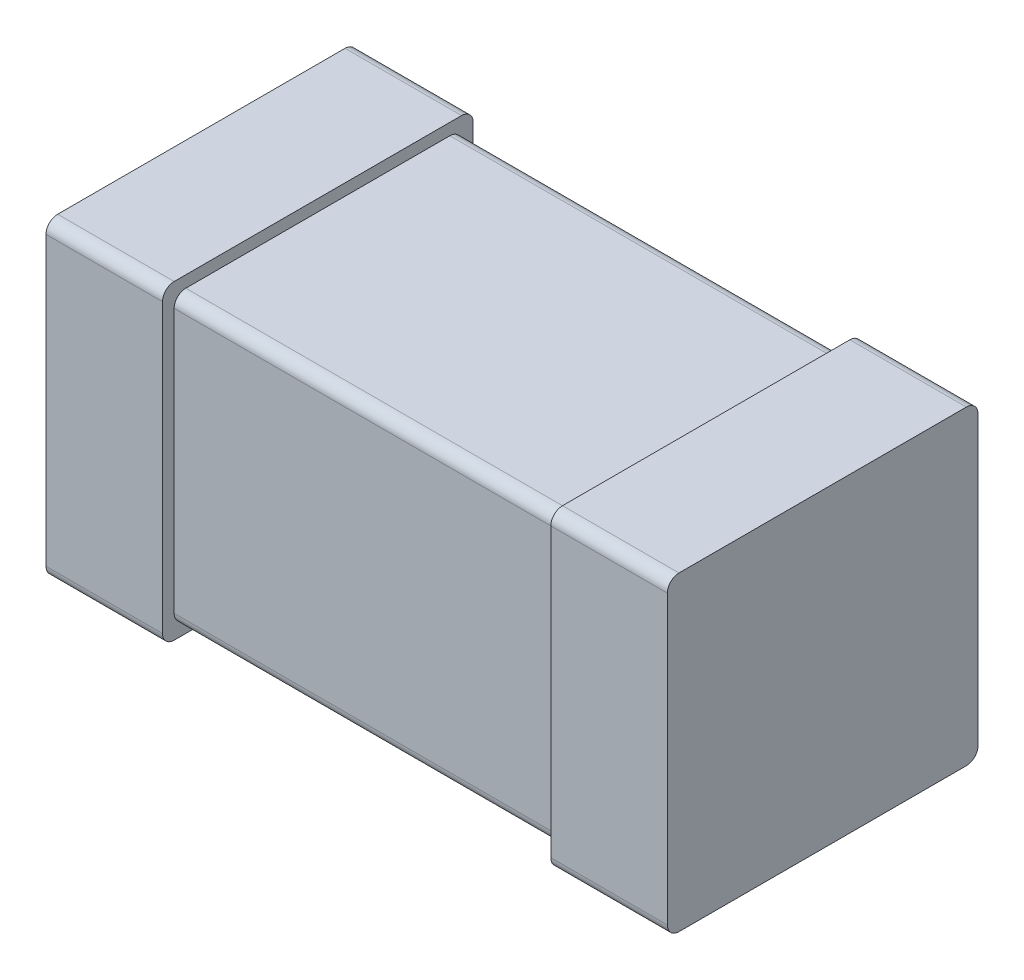
ISO-10303-21;
HEADER;
FILE_DESCRIPTION(('STEP AP214'),'2;1');
FILE_NAME('part.step','',(''),(''),'','','');
FILE_SCHEMA(('AUTOMOTIVE_DESIGN { 1 0 10303 214 1 1 1 1 }'));
ENDSEC;
DATA;
#1=APPLICATION_CONTEXT('core data for automotive mechanical design processes');
#2=APPLICATION_PROTOCOL_DEFINITION('international standard','automotive_design',2000,#1);
#3=PRODUCT_CONTEXT('',#1,'mechanical');
#4=PRODUCT('Part','Part','',(#3));
#5=PRODUCT_RELATED_PRODUCT_CATEGORY('part','',(#4));
#6=PRODUCT_DEFINITION_FORMATION('','',#4);
#7=PRODUCT_DEFINITION_CONTEXT('part definition',#1,'design');
#8=PRODUCT_DEFINITION('design','',#6,#7);
#9=PRODUCT_DEFINITION_SHAPE('','',#8);
#10=(LENGTH_UNIT() NAMED_UNIT(*) SI_UNIT(.MILLI.,.METRE.));
#11=(NAMED_UNIT(*) PLANE_ANGLE_UNIT() SI_UNIT($,.RADIAN.));
#12=(NAMED_UNIT(*) SI_UNIT($,.STERADIAN.) SOLID_ANGLE_UNIT());
#13=UNCERTAINTY_MEASURE_WITH_UNIT(LENGTH_MEASURE(1.E-05),#10,'distance_accuracy_value','');
#14=(GEOMETRIC_REPRESENTATION_CONTEXT(3) GLOBAL_UNCERTAINTY_ASSIGNED_CONTEXT((#13)) GLOBAL_UNIT_ASSIGNED_CONTEXT((#10,
#11,#12)) REPRESENTATION_CONTEXT('',''));
#15=CARTESIAN_POINT('',(0.,0.,0.));
#16=DIRECTION('',(0.,0.,1.));
#17=DIRECTION('',(1.,0.,0.));
#18=AXIS2_PLACEMENT_3D('',#15,#16,#17);
#19=CARTESIAN_POINT('',(148.022744279938,96.3440432923502,112.211582908599));
#20=DIRECTION('',(-1.,0.,0.));
#21=DIRECTION('',(0.,0.,1.));
#22=AXIS2_PLACEMENT_3D('',#19,#20,#21);
#23=PLANE('',#22);
#24=DIRECTION('',(0.,0.,1.));
#25=VECTOR('',#24,1.);
#26=CARTESIAN_POINT('',(148.022744279938,96.3440432923502,112.211582908599));
#27=LINE('',#26,#25);
#28=CARTESIAN_POINT('',(148.022744279938,96.3440432923502,112.241582908599));
#29=VERTEX_POINT('',#28);
#30=CARTESIAN_POINT('',(148.022744279938,96.3440432923502,112.981582908599));
#31=VERTEX_POINT('',#30);
#32=EDGE_CURVE('E67',#29,#31,#27,.T.);
#33=ORIENTED_EDGE('',*,*,#32,.F.);
#34=CARTESIAN_POINT('',(148.022744279938,96.3140432923502,112.241582908599));
#35=DIRECTION('',(-1.,0.,0.));
#36=DIRECTION('',(0.,0.,1.));
#37=AXIS2_PLACEMENT_3D('',#34,#35,#36);
#38=CIRCLE('',#37,0.0300000000000023);
#39=CARTESIAN_POINT('',(148.022744279938,96.3140432923502,112.211582908599));
#40=VERTEX_POINT('',#39);
#41=EDGE_CURVE('E11',#29,#40,#38,.T.);
#42=ORIENTED_EDGE('',*,*,#41,.T.);
#43=DIRECTION('',(0.,-1.,0.));
#44=VECTOR('',#43,1.);
#45=CARTESIAN_POINT('',(148.022744279938,96.3440432923502,112.211582908599));
#46=LINE('',#45,#44);
#47=CARTESIAN_POINT('',(148.022744279938,95.5740432923502,112.211582908599));
#48=VERTEX_POINT('',#47);
#49=EDGE_CURVE('E55',#40,#48,#46,.T.);
#50=ORIENTED_EDGE('',*,*,#49,.T.);
#51=CARTESIAN_POINT('',(148.022744279938,95.5740432923502,112.241582908599));
#52=DIRECTION('',(1.,0.,0.));
#53=DIRECTION('',(0.,0.,1.));
#54=AXIS2_PLACEMENT_3D('',#51,#52,#53);
#55=CIRCLE('',#54,0.0300000000000023);
#56=CARTESIAN_POINT('',(148.022744279938,95.5440432923502,112.241582908599));
#57=VERTEX_POINT('',#56);
#58=EDGE_CURVE('E328',#57,#48,#55,.T.);
#59=ORIENTED_EDGE('',*,*,#58,.F.);
#60=DIRECTION('',(0.,0.,1.));
#61=VECTOR('',#60,1.);
#62=CARTESIAN_POINT('',(148.022744279938,95.5440432923502,112.211582908599));
#63=LINE('',#62,#61);
#64=CARTESIAN_POINT('',(148.022744279938,95.5440432923502,112.981582908599));
#65=VERTEX_POINT('',#64);
#66=EDGE_CURVE('E470',#57,#65,#63,.T.);
#67=ORIENTED_EDGE('',*,*,#66,.T.);
#68=CARTESIAN_POINT('',(148.022744279938,95.5740432923502,112.981582908599));
#69=DIRECTION('',(-1.,0.,0.));
#70=DIRECTION('',(0.,0.,1.));
#71=AXIS2_PLACEMENT_3D('',#68,#69,#70);
#72=CIRCLE('',#71,0.0300000000000023);
#73=CARTESIAN_POINT('',(148.022744279938,95.5740432923502,113.011582908599));
#74=VERTEX_POINT('',#73);
#75=EDGE_CURVE('E474',#65,#74,#72,.T.);
#76=ORIENTED_EDGE('',*,*,#75,.T.);
#77=DIRECTION('',(0.,-1.,0.));
#78=VECTOR('',#77,1.);
#79=CARTESIAN_POINT('',(148.022744279938,96.3440432923502,113.011582908599));
#80=LINE('',#79,#78);
#81=CARTESIAN_POINT('',(148.022744279938,96.3140432923502,113.011582908599));
#82=VERTEX_POINT('',#81);
#83=EDGE_CURVE('E343',#82,#74,#80,.T.);
#84=ORIENTED_EDGE('',*,*,#83,.F.);
#85=CARTESIAN_POINT('',(148.022744279938,96.3140432923502,112.981582908599));
#86=DIRECTION('',(1.,0.,0.));
#87=DIRECTION('',(0.,0.,1.));
#88=AXIS2_PLACEMENT_3D('',#85,#86,#87);
#89=CIRCLE('',#88,0.0300000000000023);
#90=EDGE_CURVE('E337',#31,#82,#89,.T.);
#91=ORIENTED_EDGE('',*,*,#90,.F.);
#92=EDGE_LOOP('',(#33,#42,#50,#59,#67,#76,#84,#91));
#93=FACE_BOUND('',#92,.T.);
#94=ADVANCED_FACE('F44',(#93),#23,.T.);
#95=CARTESIAN_POINT('',(148.322744279938,95.5440432923502,112.211582908599));
#96=DIRECTION('',(0.,-1.,0.));
#97=DIRECTION('',(0.,0.,-1.));
#98=AXIS2_PLACEMENT_3D('',#95,#96,#97);
#99=PLANE('',#98);
#100=ORIENTED_EDGE('',*,*,#66,.F.);
#101=DIRECTION('',(-1.,0.,0.));
#102=VECTOR('',#101,1.);
#103=CARTESIAN_POINT('',(148.322744279938,95.5440432923502,112.241582908599));
#104=LINE('',#103,#102);
#105=CARTESIAN_POINT('',(148.322744279938,95.5440432923502,112.241582908599));
#106=VERTEX_POINT('',#105);
#107=EDGE_CURVE('E331',#106,#57,#104,.T.);
#108=ORIENTED_EDGE('',*,*,#107,.F.);
#109=DIRECTION('',(0.,0.,1.));
#110=VECTOR('',#109,1.);
#111=CARTESIAN_POINT('',(148.322744279938,95.5440432923502,112.211582908599));
#112=LINE('',#111,#110);
#113=CARTESIAN_POINT('',(148.322744279938,95.5440432923502,112.981582908599));
#114=VERTEX_POINT('',#113);
#115=EDGE_CURVE('E859',#106,#114,#112,.T.);
#116=ORIENTED_EDGE('',*,*,#115,.T.);
#117=DIRECTION('',(-1.,0.,0.));
#118=VECTOR('',#117,1.);
#119=CARTESIAN_POINT('',(148.322744279938,95.5440432923502,112.981582908599));
#120=LINE('',#119,#118);
#121=EDGE_CURVE('E854',#114,#65,#120,.T.);
#122=ORIENTED_EDGE('',*,*,#121,.T.);
#123=EDGE_LOOP('',(#100,#108,#116,#122));
#124=FACE_BOUND('',#123,.T.);
#125=ADVANCED_FACE('F547',(#124),#99,.T.);
#126=CARTESIAN_POINT('',(148.322744279938,95.5740432923502,112.981582908599));
#127=DIRECTION('',(-1.,0.,0.));
#128=DIRECTION('',(0.,-1.,0.));
#129=AXIS2_PLACEMENT_3D('',#126,#127,#128);
#130=CYLINDRICAL_SURFACE('',#129,0.0300000000000023);
#131=CARTESIAN_POINT('',(148.322744279938,95.5740432923502,112.981582908599));
#132=DIRECTION('',(-1.,0.,0.));
#133=DIRECTION('',(0.,0.,1.));
#134=AXIS2_PLACEMENT_3D('',#131,#132,#133);
#135=CIRCLE('',#134,0.0300000000000023);
#136=CARTESIAN_POINT('',(148.322744279938,95.5740432923502,113.011582908599));
#137=VERTEX_POINT('',#136);
#138=EDGE_CURVE('E433',#114,#137,#135,.T.);
#139=ORIENTED_EDGE('',*,*,#138,.T.);
#140=DIRECTION('',(-1.,0.,0.));
#141=VECTOR('',#140,1.);
#142=CARTESIAN_POINT('',(148.322744279938,95.5740432923502,113.011582908599));
#143=LINE('',#142,#141);
#144=EDGE_CURVE('E155',#137,#74,#143,.T.);
#145=ORIENTED_EDGE('',*,*,#144,.T.);
#146=ORIENTED_EDGE('',*,*,#75,.F.);
#147=ORIENTED_EDGE('',*,*,#121,.F.);
#148=EDGE_LOOP('',(#139,#145,#146,#147));
#149=FACE_BOUND('',#148,.T.);
#150=ADVANCED_FACE('F513',(#149),#130,.T.);
#151=CARTESIAN_POINT('',(148.322744279938,95.5740432923502,112.241582908599));
#152=DIRECTION('',(-1.,0.,0.));
#153=DIRECTION('',(0.,-1.,0.));
#154=AXIS2_PLACEMENT_3D('',#151,#152,#153);
#155=CYLINDRICAL_SURFACE('',#154,0.0300000000000023);
#156=ORIENTED_EDGE('',*,*,#107,.T.);
#157=ORIENTED_EDGE('',*,*,#58,.T.);
#158=DIRECTION('',(-1.,0.,0.));
#159=VECTOR('',#158,1.);
#160=CARTESIAN_POINT('',(148.322744279938,95.5740432923502,112.211582908599));
#161=LINE('',#160,#159);
#162=CARTESIAN_POINT('',(148.322744279938,95.5740432923502,112.211582908599));
#163=VERTEX_POINT('',#162);
#164=EDGE_CURVE('E339',#163,#48,#161,.T.);
#165=ORIENTED_EDGE('',*,*,#164,.F.);
#166=CARTESIAN_POINT('',(148.322744279938,95.5740432923502,112.241582908599));
#167=DIRECTION('',(1.,0.,0.));
#168=DIRECTION('',(0.,0.,1.));
#169=AXIS2_PLACEMENT_3D('',#166,#167,#168);
#170=CIRCLE('',#169,0.0300000000000023);
#171=EDGE_CURVE('E167',#106,#163,#170,.T.);
#172=ORIENTED_EDGE('',*,*,#171,.F.);
#173=EDGE_LOOP('',(#156,#157,#165,#172));
#174=FACE_BOUND('',#173,.T.);
#175=ADVANCED_FACE('F506',(#174),#155,.T.);
#176=CARTESIAN_POINT('',(148.322744279938,96.3440432923502,113.011582908599));
#177=DIRECTION('',(0.,0.,1.));
#178=DIRECTION('',(1.,0.,0.));
#179=AXIS2_PLACEMENT_3D('',#176,#177,#178);
#180=PLANE('',#179);
#181=DIRECTION('',(0.,-1.,0.));
#182=VECTOR('',#181,1.);
#183=CARTESIAN_POINT('',(148.322744279938,96.3440432923502,113.011582908599));
#184=LINE('',#183,#182);
#185=CARTESIAN_POINT('',(148.322744279938,96.3140432923502,113.011582908599));
#186=VERTEX_POINT('',#185);
#187=EDGE_CURVE('E349',#186,#137,#184,.T.);
#188=ORIENTED_EDGE('',*,*,#187,.F.);
#189=DIRECTION('',(-1.,0.,0.));
#190=VECTOR('',#189,1.);
#191=CARTESIAN_POINT('',(148.322744279938,96.3140432923502,113.011582908599));
#192=LINE('',#191,#190);
#193=EDGE_CURVE('E332',#186,#82,#192,.T.);
#194=ORIENTED_EDGE('',*,*,#193,.T.);
#195=ORIENTED_EDGE('',*,*,#83,.T.);
#196=ORIENTED_EDGE('',*,*,#144,.F.);
#197=EDGE_LOOP('',(#188,#194,#195,#196));
#198=FACE_BOUND('',#197,.T.);
#199=ADVANCED_FACE('F512',(#198),#180,.T.);
#200=CARTESIAN_POINT('',(148.322744279938,96.3440432923502,112.211582908599));
#201=DIRECTION('',(0.,0.,1.));
#202=DIRECTION('',(1.,0.,0.));
#203=AXIS2_PLACEMENT_3D('',#200,#201,#202);
#204=PLANE('',#203);
#205=ORIENTED_EDGE('',*,*,#164,.T.);
#206=ORIENTED_EDGE('',*,*,#49,.F.);
#207=DIRECTION('',(-1.,0.,0.));
#208=VECTOR('',#207,1.);
#209=CARTESIAN_POINT('',(148.322744279938,96.3140432923502,112.211582908599));
#210=LINE('',#209,#208);
#211=CARTESIAN_POINT('',(148.322744279938,96.3140432923502,112.211582908599));
#212=VERTEX_POINT('',#211);
#213=EDGE_CURVE('E338',#212,#40,#210,.T.);
#214=ORIENTED_EDGE('',*,*,#213,.F.);
#215=DIRECTION('',(0.,-1.,0.));
#216=VECTOR('',#215,1.);
#217=CARTESIAN_POINT('',(148.322744279938,96.3440432923502,112.211582908599));
#218=LINE('',#217,#216);
#219=EDGE_CURVE('E344',#212,#163,#218,.T.);
#220=ORIENTED_EDGE('',*,*,#219,.T.);
#221=EDGE_LOOP('',(#205,#206,#214,#220));
#222=FACE_BOUND('',#221,.T.);
#223=ADVANCED_FACE('F46',(#222),#204,.F.);
#224=CARTESIAN_POINT('',(148.322744279938,96.3140432923502,112.981582908599));
#225=DIRECTION('',(-1.,0.,0.));
#226=DIRECTION('',(0.,1.,0.));
#227=AXIS2_PLACEMENT_3D('',#224,#225,#226);
#228=CYLINDRICAL_SURFACE('',#227,0.0300000000000023);
#229=DIRECTION('',(-1.,0.,0.));
#230=VECTOR('',#229,1.);
#231=CARTESIAN_POINT('',(148.322744279938,96.3440432923502,112.981582908599));
#232=LINE('',#231,#230);
#233=CARTESIAN_POINT('',(148.322744279938,96.3440432923502,112.981582908599));
#234=VERTEX_POINT('',#233);
#235=EDGE_CURVE('E375',#234,#31,#232,.T.);
#236=ORIENTED_EDGE('',*,*,#235,.T.);
#237=ORIENTED_EDGE('',*,*,#90,.T.);
#238=ORIENTED_EDGE('',*,*,#193,.F.);
#239=CARTESIAN_POINT('',(148.322744279938,96.3140432923502,112.981582908599));
#240=DIRECTION('',(1.,0.,0.));
#241=DIRECTION('',(0.,0.,1.));
#242=AXIS2_PLACEMENT_3D('',#239,#240,#241);
#243=CIRCLE('',#242,0.0300000000000023);
#244=EDGE_CURVE('E436',#234,#186,#243,.T.);
#245=ORIENTED_EDGE('',*,*,#244,.F.);
#246=EDGE_LOOP('',(#236,#237,#238,#245));
#247=FACE_BOUND('',#246,.T.);
#248=ADVANCED_FACE('F655',(#247),#228,.T.);
#249=CARTESIAN_POINT('',(148.322744279938,96.3140432923502,112.241582908599));
#250=DIRECTION('',(-1.,0.,0.));
#251=DIRECTION('',(0.,1.,0.));
#252=AXIS2_PLACEMENT_3D('',#249,#250,#251);
#253=CYLINDRICAL_SURFACE('',#252,0.0300000000000023);
#254=CARTESIAN_POINT('',(148.322744279938,96.3140432923502,112.241582908599));
#255=DIRECTION('',(-1.,0.,0.));
#256=DIRECTION('',(0.,0.,1.));
#257=AXIS2_PLACEMENT_3D('',#254,#255,#256);
#258=CIRCLE('',#257,0.0300000000000023);
#259=CARTESIAN_POINT('',(148.322744279938,96.3440432923502,112.241582908599));
#260=VERTEX_POINT('',#259);
#261=EDGE_CURVE('E333',#260,#212,#258,.T.);
#262=ORIENTED_EDGE('',*,*,#261,.T.);
#263=ORIENTED_EDGE('',*,*,#213,.T.);
#264=ORIENTED_EDGE('',*,*,#41,.F.);
#265=DIRECTION('',(-1.,0.,0.));
#266=VECTOR('',#265,1.);
#267=CARTESIAN_POINT('',(148.322744279938,96.3440432923502,112.241582908599));
#268=LINE('',#267,#266);
#269=EDGE_CURVE('E395',#260,#29,#268,.T.);
#270=ORIENTED_EDGE('',*,*,#269,.F.);
#271=EDGE_LOOP('',(#262,#263,#264,#270));
#272=FACE_BOUND('',#271,.T.);
#273=ADVANCED_FACE('F643',(#272),#253,.T.);
#274=CARTESIAN_POINT('',(148.322744279938,96.3440432923502,112.211582908599));
#275=DIRECTION('',(0.,-1.,0.));
#276=DIRECTION('',(0.,0.,-1.));
#277=AXIS2_PLACEMENT_3D('',#274,#275,#276);
#278=PLANE('',#277);
#279=ORIENTED_EDGE('',*,*,#235,.F.);
#280=DIRECTION('',(0.,0.,1.));
#281=VECTOR('',#280,1.);
#282=CARTESIAN_POINT('',(148.322744279938,96.3440432923502,112.211582908599));
#283=LINE('',#282,#281);
#284=EDGE_CURVE('E302',#260,#234,#283,.T.);
#285=ORIENTED_EDGE('',*,*,#284,.F.);
#286=ORIENTED_EDGE('',*,*,#269,.T.);
#287=ORIENTED_EDGE('',*,*,#32,.T.);
#288=EDGE_LOOP('',(#279,#285,#286,#287));
#289=FACE_BOUND('',#288,.T.);
#290=ADVANCED_FACE('F563',(#289),#278,.F.);
#291=CARTESIAN_POINT('',(148.322744279938,96.3440432923502,112.211582908599));
#292=DIRECTION('',(-1.,0.,0.));
#293=DIRECTION('',(0.,0.,1.));
#294=AXIS2_PLACEMENT_3D('',#291,#292,#293);
#295=PLANE('',#294);
#296=ORIENTED_EDGE('',*,*,#244,.T.);
#297=ORIENTED_EDGE('',*,*,#187,.T.);
#298=ORIENTED_EDGE('',*,*,#138,.F.);
#299=ORIENTED_EDGE('',*,*,#115,.F.);
#300=ORIENTED_EDGE('',*,*,#171,.T.);
#301=ORIENTED_EDGE('',*,*,#219,.F.);
#302=ORIENTED_EDGE('',*,*,#261,.F.);
#303=ORIENTED_EDGE('',*,*,#284,.T.);
#304=EDGE_LOOP('',(#296,#297,#298,#299,#300,#301,#302,#303));
#305=FACE_BOUND('',#304,.T.);
#306=DIRECTION('',(0.,-1.,0.));
#307=VECTOR('',#306,1.);
#308=CARTESIAN_POINT('',(148.322744279938,96.3140432923502,112.241582908599));
#309=LINE('',#308,#307);
#310=CARTESIAN_POINT('',(148.322744279938,96.2840432923502,112.241582908599));
#311=VERTEX_POINT('',#310);
#312=CARTESIAN_POINT('',(148.322744279938,95.6040432923502,112.241582908599));
#313=VERTEX_POINT('',#312);
#314=EDGE_CURVE('E281',#311,#313,#309,.T.);
#315=ORIENTED_EDGE('',*,*,#314,.T.);
#316=CARTESIAN_POINT('',(148.322744279938,95.6040432923502,112.271582908599));
#317=DIRECTION('',(1.,0.,0.));
#318=DIRECTION('',(0.,0.,1.));
#319=AXIS2_PLACEMENT_3D('',#316,#317,#318);
#320=CIRCLE('',#319,0.0300000000000023);
#321=CARTESIAN_POINT('',(148.322744279938,95.5740432923502,112.271582908599));
#322=VERTEX_POINT('',#321);
#323=EDGE_CURVE('E414',#322,#313,#320,.T.);
#324=ORIENTED_EDGE('',*,*,#323,.F.);
#325=DIRECTION('',(0.,0.,1.));
#326=VECTOR('',#325,1.);
#327=CARTESIAN_POINT('',(148.322744279938,95.5740432923502,112.241582908599));
#328=LINE('',#327,#326);
#329=CARTESIAN_POINT('',(148.322744279938,95.5740432923502,112.951582908599));
#330=VERTEX_POINT('',#329);
#331=EDGE_CURVE('E303',#322,#330,#328,.T.);
#332=ORIENTED_EDGE('',*,*,#331,.T.);
#333=CARTESIAN_POINT('',(148.322744279938,95.6040432923502,112.951582908599));
#334=DIRECTION('',(-1.,0.,0.));
#335=DIRECTION('',(0.,0.,1.));
#336=AXIS2_PLACEMENT_3D('',#333,#334,#335);
#337=CIRCLE('',#336,0.0300000000000023);
#338=CARTESIAN_POINT('',(148.322744279938,95.6040432923502,112.981582908599));
#339=VERTEX_POINT('',#338);
#340=EDGE_CURVE('E291',#330,#339,#337,.T.);
#341=ORIENTED_EDGE('',*,*,#340,.T.);
#342=DIRECTION('',(0.,-1.,0.));
#343=VECTOR('',#342,1.);
#344=CARTESIAN_POINT('',(148.322744279938,96.3140432923502,112.981582908599));
#345=LINE('',#344,#343);
#346=CARTESIAN_POINT('',(148.322744279938,96.2840432923502,112.981582908599));
#347=VERTEX_POINT('',#346);
#348=EDGE_CURVE('E324',#347,#339,#345,.T.);
#349=ORIENTED_EDGE('',*,*,#348,.F.);
#350=CARTESIAN_POINT('',(148.322744279938,96.2840432923502,112.951582908599));
#351=DIRECTION('',(1.,0.,0.));
#352=DIRECTION('',(0.,0.,1.));
#353=AXIS2_PLACEMENT_3D('',#350,#351,#352);
#354=CIRCLE('',#353,0.0300000000000023);
#355=CARTESIAN_POINT('',(148.322744279938,96.3140432923502,112.951582908599));
#356=VERTEX_POINT('',#355);
#357=EDGE_CURVE('E379',#356,#347,#354,.T.);
#358=ORIENTED_EDGE('',*,*,#357,.F.);
#359=DIRECTION('',(0.,0.,1.));
#360=VECTOR('',#359,1.);
#361=CARTESIAN_POINT('',(148.322744279938,96.3140432923502,112.241582908599));
#362=LINE('',#361,#360);
#363=CARTESIAN_POINT('',(148.322744279938,96.3140432923502,112.271582908599));
#364=VERTEX_POINT('',#363);
#365=EDGE_CURVE('E285',#364,#356,#362,.T.);
#366=ORIENTED_EDGE('',*,*,#365,.F.);
#367=CARTESIAN_POINT('',(148.322744279938,96.2840432923502,112.271582908599));
#368=DIRECTION('',(-1.,0.,0.));
#369=DIRECTION('',(0.,0.,1.));
#370=AXIS2_PLACEMENT_3D('',#367,#368,#369);
#371=CIRCLE('',#370,0.0300000000000023);
#372=EDGE_CURVE('E277',#364,#311,#371,.T.);
#373=ORIENTED_EDGE('',*,*,#372,.T.);
#374=EDGE_LOOP('',(#315,#324,#332,#341,#349,#358,#366,#373));
#375=FACE_BOUND('',#374,.T.);
#376=ADVANCED_FACE('F279',(#305,#375),#295,.F.);
#377=CARTESIAN_POINT('',(149.322744279938,96.3140432923502,112.241582908599));
#378=DIRECTION('',(0.,-1.,0.));
#379=DIRECTION('',(0.,0.,-1.));
#380=AXIS2_PLACEMENT_3D('',#377,#378,#379);
#381=PLANE('',#380);
#382=DIRECTION('',(-1.,0.,0.));
#383=VECTOR('',#382,1.);
#384=CARTESIAN_POINT('',(149.322744279938,96.3140432923502,112.951582908599));
#385=LINE('',#384,#383);
#386=CARTESIAN_POINT('',(149.322744279938,96.3140432923502,112.951582908599));
#387=VERTEX_POINT('',#386);
#388=EDGE_CURVE('E376',#387,#356,#385,.T.);
#389=ORIENTED_EDGE('',*,*,#388,.F.);
#390=DIRECTION('',(0.,0.,1.));
#391=VECTOR('',#390,1.);
#392=CARTESIAN_POINT('',(149.322744279938,96.3140432923502,112.241582908599));
#393=LINE('',#392,#391);
#394=CARTESIAN_POINT('',(149.322744279938,96.3140432923502,112.271582908599));
#395=VERTEX_POINT('',#394);
#396=EDGE_CURVE('E48',#395,#387,#393,.T.);
#397=ORIENTED_EDGE('',*,*,#396,.F.);
#398=DIRECTION('',(-1.,0.,0.));
#399=VECTOR('',#398,1.);
#400=CARTESIAN_POINT('',(149.322744279938,96.3140432923502,112.271582908599));
#401=LINE('',#400,#399);
#402=EDGE_CURVE('E292',#395,#364,#401,.T.);
#403=ORIENTED_EDGE('',*,*,#402,.T.);
#404=ORIENTED_EDGE('',*,*,#365,.T.);
#405=EDGE_LOOP('',(#389,#397,#403,#404));
#406=FACE_BOUND('',#405,.T.);
#407=ADVANCED_FACE('F562',(#406),#381,.F.);
#408=CARTESIAN_POINT('',(149.322744279938,96.2840432923502,112.951582908599));
#409=DIRECTION('',(-1.,0.,0.));
#410=DIRECTION('',(0.,1.,0.));
#411=AXIS2_PLACEMENT_3D('',#408,#409,#410);
#412=CYLINDRICAL_SURFACE('',#411,0.0300000000000023);
#413=ORIENTED_EDGE('',*,*,#388,.T.);
#414=ORIENTED_EDGE('',*,*,#357,.T.);
#415=DIRECTION('',(-1.,0.,0.));
#416=VECTOR('',#415,1.);
#417=CARTESIAN_POINT('',(149.322744279938,96.2840432923502,112.981582908599));
#418=LINE('',#417,#416);
#419=CARTESIAN_POINT('',(149.322744279938,96.2840432923502,112.981582908599));
#420=VERTEX_POINT('',#419);
#421=EDGE_CURVE('E326',#420,#347,#418,.T.);
#422=ORIENTED_EDGE('',*,*,#421,.F.);
#423=CARTESIAN_POINT('',(149.322744279938,96.2840432923502,112.951582908599));
#424=DIRECTION('',(1.,0.,0.));
#425=DIRECTION('',(0.,0.,1.));
#426=AXIS2_PLACEMENT_3D('',#423,#424,#425);
#427=CIRCLE('',#426,0.0300000000000023);
#428=EDGE_CURVE('E401',#387,#420,#427,.T.);
#429=ORIENTED_EDGE('',*,*,#428,.F.);
#430=EDGE_LOOP('',(#413,#414,#422,#429));
#431=FACE_BOUND('',#430,.T.);
#432=ADVANCED_FACE('F581',(#431),#412,.T.);
#433=CARTESIAN_POINT('',(149.322744279938,96.3140432923502,112.981582908599));
#434=DIRECTION('',(0.,0.,1.));
#435=DIRECTION('',(1.,0.,0.));
#436=AXIS2_PLACEMENT_3D('',#433,#434,#435);
#437=PLANE('',#436);
#438=DIRECTION('',(0.,-1.,0.));
#439=VECTOR('',#438,1.);
#440=CARTESIAN_POINT('',(149.322744279938,96.3140432923502,112.981582908599));
#441=LINE('',#440,#439);
#442=CARTESIAN_POINT('',(149.322744279938,95.6040432923502,112.981582908599));
#443=VERTEX_POINT('',#442);
#444=EDGE_CURVE('E397',#420,#443,#441,.T.);
#445=ORIENTED_EDGE('',*,*,#444,.F.);
#446=ORIENTED_EDGE('',*,*,#421,.T.);
#447=ORIENTED_EDGE('',*,*,#348,.T.);
#448=DIRECTION('',(-1.,0.,0.));
#449=VECTOR('',#448,1.);
#450=CARTESIAN_POINT('',(149.322744279938,95.6040432923502,112.981582908599));
#451=LINE('',#450,#449);
#452=EDGE_CURVE('E368',#443,#339,#451,.T.);
#453=ORIENTED_EDGE('',*,*,#452,.F.);
#454=EDGE_LOOP('',(#445,#446,#447,#453));
#455=FACE_BOUND('',#454,.T.);
#456=ADVANCED_FACE('F585',(#455),#437,.T.);
#457=CARTESIAN_POINT('',(149.322744279938,95.6040432923502,112.951582908599));
#458=DIRECTION('',(-1.,0.,0.));
#459=DIRECTION('',(0.,-1.,0.));
#460=AXIS2_PLACEMENT_3D('',#457,#458,#459);
#461=CYLINDRICAL_SURFACE('',#460,0.0300000000000023);
#462=CARTESIAN_POINT('',(149.322744279938,95.6040432923502,112.951582908599));
#463=DIRECTION('',(-1.,0.,0.));
#464=DIRECTION('',(0.,0.,1.));
#465=AXIS2_PLACEMENT_3D('',#462,#463,#464);
#466=CIRCLE('',#465,0.0300000000000023);
#467=CARTESIAN_POINT('',(149.322744279938,95.5740432923502,112.951582908599));
#468=VERTEX_POINT('',#467);
#469=EDGE_CURVE('E327',#468,#443,#466,.T.);
#470=ORIENTED_EDGE('',*,*,#469,.T.);
#471=ORIENTED_EDGE('',*,*,#452,.T.);
#472=ORIENTED_EDGE('',*,*,#340,.F.);
#473=DIRECTION('',(-1.,0.,0.));
#474=VECTOR('',#473,1.);
#475=CARTESIAN_POINT('',(149.322744279938,95.5740432923502,112.951582908599));
#476=LINE('',#475,#474);
#477=EDGE_CURVE('E406',#468,#330,#476,.T.);
#478=ORIENTED_EDGE('',*,*,#477,.F.);
#479=EDGE_LOOP('',(#470,#471,#472,#478));
#480=FACE_BOUND('',#479,.T.);
#481=ADVANCED_FACE('F594',(#480),#461,.T.);
#482=CARTESIAN_POINT('',(149.322744279938,95.5740432923502,112.241582908599));
#483=DIRECTION('',(0.,-1.,0.));
#484=DIRECTION('',(0.,0.,-1.));
#485=AXIS2_PLACEMENT_3D('',#482,#483,#484);
#486=PLANE('',#485);
#487=ORIENTED_EDGE('',*,*,#331,.F.);
#488=DIRECTION('',(-1.,0.,0.));
#489=VECTOR('',#488,1.);
#490=CARTESIAN_POINT('',(149.322744279938,95.5740432923502,112.271582908599));
#491=LINE('',#490,#489);
#492=CARTESIAN_POINT('',(149.322744279938,95.5740432923502,112.271582908599));
#493=VERTEX_POINT('',#492);
#494=EDGE_CURVE('E410',#493,#322,#491,.T.);
#495=ORIENTED_EDGE('',*,*,#494,.F.);
#496=DIRECTION('',(0.,0.,1.));
#497=VECTOR('',#496,1.);
#498=CARTESIAN_POINT('',(149.322744279938,95.5740432923502,112.241582908599));
#499=LINE('',#498,#497);
#500=EDGE_CURVE('E372',#493,#468,#499,.T.);
#501=ORIENTED_EDGE('',*,*,#500,.T.);
#502=ORIENTED_EDGE('',*,*,#477,.T.);
#503=EDGE_LOOP('',(#487,#495,#501,#502));
#504=FACE_BOUND('',#503,.T.);
#505=ADVANCED_FACE('F598',(#504),#486,.T.);
#506=CARTESIAN_POINT('',(149.322744279938,95.6040432923502,112.271582908599));
#507=DIRECTION('',(-1.,0.,0.));
#508=DIRECTION('',(0.,-1.,0.));
#509=AXIS2_PLACEMENT_3D('',#506,#507,#508);
#510=CYLINDRICAL_SURFACE('',#509,0.0300000000000023);
#511=ORIENTED_EDGE('',*,*,#494,.T.);
#512=ORIENTED_EDGE('',*,*,#323,.T.);
#513=DIRECTION('',(-1.,0.,0.));
#514=VECTOR('',#513,1.);
#515=CARTESIAN_POINT('',(149.322744279938,95.6040432923502,112.241582908599));
#516=LINE('',#515,#514);
#517=CARTESIAN_POINT('',(149.322744279938,95.6040432923502,112.241582908599));
#518=VERTEX_POINT('',#517);
#519=EDGE_CURVE('E300',#518,#313,#516,.T.);
#520=ORIENTED_EDGE('',*,*,#519,.F.);
#521=CARTESIAN_POINT('',(149.322744279938,95.6040432923502,112.271582908599));
#522=DIRECTION('',(1.,0.,0.));
#523=DIRECTION('',(0.,0.,1.));
#524=AXIS2_PLACEMENT_3D('',#521,#522,#523);
#525=CIRCLE('',#524,0.0300000000000023);
#526=EDGE_CURVE('E402',#493,#518,#525,.T.);
#527=ORIENTED_EDGE('',*,*,#526,.F.);
#528=EDGE_LOOP('',(#511,#512,#520,#527));
#529=FACE_BOUND('',#528,.T.);
#530=ADVANCED_FACE('F525',(#529),#510,.T.);
#531=CARTESIAN_POINT('',(149.322744279938,96.3140432923502,112.241582908599));
#532=DIRECTION('',(0.,0.,1.));
#533=DIRECTION('',(1.,0.,0.));
#534=AXIS2_PLACEMENT_3D('',#531,#532,#533);
#535=PLANE('',#534);
#536=ORIENTED_EDGE('',*,*,#519,.T.);
#537=ORIENTED_EDGE('',*,*,#314,.F.);
#538=DIRECTION('',(-1.,0.,0.));
#539=VECTOR('',#538,1.);
#540=CARTESIAN_POINT('',(149.322744279938,96.2840432923502,112.241582908599));
#541=LINE('',#540,#539);
#542=CARTESIAN_POINT('',(149.322744279938,96.2840432923502,112.241582908599));
#543=VERTEX_POINT('',#542);
#544=EDGE_CURVE('E297',#543,#311,#541,.T.);
#545=ORIENTED_EDGE('',*,*,#544,.F.);
#546=DIRECTION('',(0.,-1.,0.));
#547=VECTOR('',#546,1.);
#548=CARTESIAN_POINT('',(149.322744279938,96.3140432923502,112.241582908599));
#549=LINE('',#548,#547);
#550=EDGE_CURVE('E315',#543,#518,#549,.T.);
#551=ORIENTED_EDGE('',*,*,#550,.T.);
#552=EDGE_LOOP('',(#536,#537,#545,#551));
#553=FACE_BOUND('',#552,.T.);
#554=ADVANCED_FACE('F295',(#553),#535,.F.);
#555=CARTESIAN_POINT('',(149.322744279938,96.2840432923502,112.271582908599));
#556=DIRECTION('',(-1.,0.,0.));
#557=DIRECTION('',(0.,1.,0.));
#558=AXIS2_PLACEMENT_3D('',#555,#556,#557);
#559=CYLINDRICAL_SURFACE('',#558,0.0300000000000023);
#560=CARTESIAN_POINT('',(149.322744279938,96.2840432923502,112.271582908599));
#561=DIRECTION('',(-1.,0.,0.));
#562=DIRECTION('',(0.,0.,1.));
#563=AXIS2_PLACEMENT_3D('',#560,#561,#562);
#564=CIRCLE('',#563,0.0300000000000023);
#565=EDGE_CURVE('E307',#395,#543,#564,.T.);
#566=ORIENTED_EDGE('',*,*,#565,.T.);
#567=ORIENTED_EDGE('',*,*,#544,.T.);
#568=ORIENTED_EDGE('',*,*,#372,.F.);
#569=ORIENTED_EDGE('',*,*,#402,.F.);
#570=EDGE_LOOP('',(#566,#567,#568,#569));
#571=FACE_BOUND('',#570,.T.);
#572=ADVANCED_FACE('F306',(#571),#559,.T.);
#573=CARTESIAN_POINT('',(149.322744279938,96.3440432923502,112.211582908599));
#574=DIRECTION('',(-1.,0.,0.));
#575=DIRECTION('',(0.,0.,1.));
#576=AXIS2_PLACEMENT_3D('',#573,#574,#575);
#577=PLANE('',#576);
#578=DIRECTION('',(0.,0.,1.));
#579=VECTOR('',#578,1.);
#580=CARTESIAN_POINT('',(149.322744279938,96.3440432923502,112.211582908599));
#581=LINE('',#580,#579);
#582=CARTESIAN_POINT('',(149.322744279938,96.3440432923502,112.241582908599));
#583=VERTEX_POINT('',#582);
#584=CARTESIAN_POINT('',(149.322744279938,96.3440432923502,112.981582908599));
#585=VERTEX_POINT('',#584);
#586=EDGE_CURVE('E429',#583,#585,#581,.T.);
#587=ORIENTED_EDGE('',*,*,#586,.F.);
#588=CARTESIAN_POINT('',(149.322744279938,96.3140432923502,112.241582908599));
#589=DIRECTION('',(-1.,0.,0.));
#590=DIRECTION('',(0.,0.,1.));
#591=AXIS2_PLACEMENT_3D('',#588,#589,#590);
#592=CIRCLE('',#591,0.0300000000000023);
#593=CARTESIAN_POINT('',(149.322744279938,96.3140432923502,112.211582908599));
#594=VERTEX_POINT('',#593);
#595=EDGE_CURVE('E309',#583,#594,#592,.T.);
#596=ORIENTED_EDGE('',*,*,#595,.T.);
#597=DIRECTION('',(0.,-1.,0.));
#598=VECTOR('',#597,1.);
#599=CARTESIAN_POINT('',(149.322744279938,96.3440432923502,112.211582908599));
#600=LINE('',#599,#598);
#601=CARTESIAN_POINT('',(149.322744279938,95.5740432923502,112.211582908599));
#602=VERTEX_POINT('',#601);
#603=EDGE_CURVE('E319',#594,#602,#600,.T.);
#604=ORIENTED_EDGE('',*,*,#603,.T.);
#605=CARTESIAN_POINT('',(149.322744279938,95.5740432923502,112.241582908599));
#606=DIRECTION('',(1.,0.,0.));
#607=DIRECTION('',(0.,0.,1.));
#608=AXIS2_PLACEMENT_3D('',#605,#606,#607);
#609=CIRCLE('',#608,0.0300000000000023);
#610=CARTESIAN_POINT('',(149.322744279938,95.5440432923502,112.241582908599));
#611=VERTEX_POINT('',#610);
#612=EDGE_CURVE('E184',#611,#602,#609,.T.);
#613=ORIENTED_EDGE('',*,*,#612,.F.);
#614=DIRECTION('',(0.,0.,1.));
#615=VECTOR('',#614,1.);
#616=CARTESIAN_POINT('',(149.322744279938,95.5440432923502,112.211582908599));
#617=LINE('',#616,#615);
#618=CARTESIAN_POINT('',(149.322744279938,95.5440432923502,112.981582908599));
#619=VERTEX_POINT('',#618);
#620=EDGE_CURVE('E469',#611,#619,#617,.T.);
#621=ORIENTED_EDGE('',*,*,#620,.T.);
#622=CARTESIAN_POINT('',(149.322744279938,95.5740432923502,112.981582908599));
#623=DIRECTION('',(-1.,0.,0.));
#624=DIRECTION('',(0.,0.,1.));
#625=AXIS2_PLACEMENT_3D('',#622,#623,#624);
#626=CIRCLE('',#625,0.0300000000000023);
#627=CARTESIAN_POINT('',(149.322744279938,95.5740432923502,113.011582908599));
#628=VERTEX_POINT('',#627);
#629=EDGE_CURVE('E198',#619,#628,#626,.T.);
#630=ORIENTED_EDGE('',*,*,#629,.T.);
#631=DIRECTION('',(0.,-1.,0.));
#632=VECTOR('',#631,1.);
#633=CARTESIAN_POINT('',(149.322744279938,96.3440432923502,113.011582908599));
#634=LINE('',#633,#632);
#635=CARTESIAN_POINT('',(149.322744279938,96.3140432923502,113.011582908599));
#636=VERTEX_POINT('',#635);
#637=EDGE_CURVE('E381',#636,#628,#634,.T.);
#638=ORIENTED_EDGE('',*,*,#637,.F.);
#639=CARTESIAN_POINT('',(149.322744279938,96.3140432923502,112.981582908599));
#640=DIRECTION('',(1.,0.,0.));
#641=DIRECTION('',(0.,0.,1.));
#642=AXIS2_PLACEMENT_3D('',#639,#640,#641);
#643=CIRCLE('',#642,0.0300000000000023);
#644=EDGE_CURVE('E366',#585,#636,#643,.T.);
#645=ORIENTED_EDGE('',*,*,#644,.F.);
#646=EDGE_LOOP('',(#587,#596,#604,#613,#621,#630,#638,#645));
#647=FACE_BOUND('',#646,.T.);
#648=ORIENTED_EDGE('',*,*,#565,.F.);
#649=ORIENTED_EDGE('',*,*,#396,.T.);
#650=ORIENTED_EDGE('',*,*,#428,.T.);
#651=ORIENTED_EDGE('',*,*,#444,.T.);
#652=ORIENTED_EDGE('',*,*,#469,.F.);
#653=ORIENTED_EDGE('',*,*,#500,.F.);
#654=ORIENTED_EDGE('',*,*,#526,.T.);
#655=ORIENTED_EDGE('',*,*,#550,.F.);
#656=EDGE_LOOP('',(#648,#649,#650,#651,#652,#653,#654,#655));
#657=FACE_BOUND('',#656,.T.);
#658=ADVANCED_FACE('F538',(#647,#657),#577,.T.);
#659=CARTESIAN_POINT('',(149.622744279938,95.5440432923502,112.211582908599));
#660=DIRECTION('',(0.,-1.,0.));
#661=DIRECTION('',(0.,0.,-1.));
#662=AXIS2_PLACEMENT_3D('',#659,#660,#661);
#663=PLANE('',#662);
#664=ORIENTED_EDGE('',*,*,#620,.F.);
#665=DIRECTION('',(-1.,0.,0.));
#666=VECTOR('',#665,1.);
#667=CARTESIAN_POINT('',(149.622744279938,95.5440432923502,112.241582908599));
#668=LINE('',#667,#666);
#669=CARTESIAN_POINT('',(149.622744279938,95.5440432923502,112.241582908599));
#670=VERTEX_POINT('',#669);
#671=EDGE_CURVE('E419',#670,#611,#668,.T.);
#672=ORIENTED_EDGE('',*,*,#671,.F.);
#673=DIRECTION('',(0.,0.,1.));
#674=VECTOR('',#673,1.);
#675=CARTESIAN_POINT('',(149.622744279938,95.5440432923502,112.211582908599));
#676=LINE('',#675,#674);
#677=CARTESIAN_POINT('',(149.622744279938,95.5440432923502,112.981582908599));
#678=VERTEX_POINT('',#677);
#679=EDGE_CURVE('E354',#670,#678,#676,.T.);
#680=ORIENTED_EDGE('',*,*,#679,.T.);
#681=DIRECTION('',(-1.,0.,0.));
#682=VECTOR('',#681,1.);
#683=CARTESIAN_POINT('',(149.622744279938,95.5440432923502,112.981582908599));
#684=LINE('',#683,#682);
#685=EDGE_CURVE('E350',#678,#619,#684,.T.);
#686=ORIENTED_EDGE('',*,*,#685,.T.);
#687=EDGE_LOOP('',(#664,#672,#680,#686));
#688=FACE_BOUND('',#687,.T.);
#689=ADVANCED_FACE('F533',(#688),#663,.T.);
#690=CARTESIAN_POINT('',(149.622744279938,95.5740432923502,112.981582908599));
#691=DIRECTION('',(-1.,0.,0.));
#692=DIRECTION('',(0.,-1.,0.));
#693=AXIS2_PLACEMENT_3D('',#690,#691,#692);
#694=CYLINDRICAL_SURFACE('',#693,0.0300000000000023);
#695=CARTESIAN_POINT('',(149.622744279938,95.5740432923502,112.981582908599));
#696=DIRECTION('',(-1.,0.,0.));
#697=DIRECTION('',(0.,0.,1.));
#698=AXIS2_PLACEMENT_3D('',#695,#696,#697);
#699=CIRCLE('',#698,0.0300000000000023);
#700=CARTESIAN_POINT('',(149.622744279938,95.5740432923502,113.011582908599));
#701=VERTEX_POINT('',#700);
#702=EDGE_CURVE('E355',#678,#701,#699,.T.);
#703=ORIENTED_EDGE('',*,*,#702,.T.);
#704=DIRECTION('',(-1.,0.,0.));
#705=VECTOR('',#704,1.);
#706=CARTESIAN_POINT('',(149.622744279938,95.5740432923502,113.011582908599));
#707=LINE('',#706,#705);
#708=EDGE_CURVE('E359',#701,#628,#707,.T.);
#709=ORIENTED_EDGE('',*,*,#708,.T.);
#710=ORIENTED_EDGE('',*,*,#629,.F.);
#711=ORIENTED_EDGE('',*,*,#685,.F.);
#712=EDGE_LOOP('',(#703,#709,#710,#711));
#713=FACE_BOUND('',#712,.T.);
#714=ADVANCED_FACE('F537',(#713),#694,.T.);
#715=CARTESIAN_POINT('',(149.622744279938,95.5740432923502,112.241582908599));
#716=DIRECTION('',(-1.,0.,0.));
#717=DIRECTION('',(0.,-1.,0.));
#718=AXIS2_PLACEMENT_3D('',#715,#716,#717);
#719=CYLINDRICAL_SURFACE('',#718,0.0300000000000023);
#720=ORIENTED_EDGE('',*,*,#671,.T.);
#721=ORIENTED_EDGE('',*,*,#612,.T.);
#722=DIRECTION('',(-1.,0.,0.));
#723=VECTOR('',#722,1.);
#724=CARTESIAN_POINT('',(149.622744279938,95.5740432923502,112.211582908599));
#725=LINE('',#724,#723);
#726=CARTESIAN_POINT('',(149.622744279938,95.5740432923502,112.211582908599));
#727=VERTEX_POINT('',#726);
#728=EDGE_CURVE('E385',#727,#602,#725,.T.);
#729=ORIENTED_EDGE('',*,*,#728,.F.);
#730=CARTESIAN_POINT('',(149.622744279938,95.5740432923502,112.241582908599));
#731=DIRECTION('',(1.,0.,0.));
#732=DIRECTION('',(0.,0.,1.));
#733=AXIS2_PLACEMENT_3D('',#730,#731,#732);
#734=CIRCLE('',#733,0.0300000000000023);
#735=EDGE_CURVE('E440',#670,#727,#734,.T.);
#736=ORIENTED_EDGE('',*,*,#735,.F.);
#737=EDGE_LOOP('',(#720,#721,#729,#736));
#738=FACE_BOUND('',#737,.T.);
#739=ADVANCED_FACE('F710',(#738),#719,.T.);
#740=CARTESIAN_POINT('',(149.622744279938,96.3440432923502,113.011582908599));
#741=DIRECTION('',(0.,0.,1.));
#742=DIRECTION('',(1.,0.,0.));
#743=AXIS2_PLACEMENT_3D('',#740,#741,#742);
#744=PLANE('',#743);
#745=DIRECTION('',(0.,-1.,0.));
#746=VECTOR('',#745,1.);
#747=CARTESIAN_POINT('',(149.622744279938,96.3440432923502,113.011582908599));
#748=LINE('',#747,#746);
#749=CARTESIAN_POINT('',(149.622744279938,96.3140432923502,113.011582908599));
#750=VERTEX_POINT('',#749);
#751=EDGE_CURVE('E430',#750,#701,#748,.T.);
#752=ORIENTED_EDGE('',*,*,#751,.F.);
#753=DIRECTION('',(-1.,0.,0.));
#754=VECTOR('',#753,1.);
#755=CARTESIAN_POINT('',(149.622744279938,96.3140432923502,113.011582908599));
#756=LINE('',#755,#754);
#757=EDGE_CURVE('E384',#750,#636,#756,.T.);
#758=ORIENTED_EDGE('',*,*,#757,.T.);
#759=ORIENTED_EDGE('',*,*,#637,.T.);
#760=ORIENTED_EDGE('',*,*,#708,.F.);
#761=EDGE_LOOP('',(#752,#758,#759,#760));
#762=FACE_BOUND('',#761,.T.);
#763=ADVANCED_FACE('F714',(#762),#744,.T.);
#764=CARTESIAN_POINT('',(149.622744279938,96.3440432923502,112.211582908599));
#765=DIRECTION('',(0.,0.,1.));
#766=DIRECTION('',(1.,0.,0.));
#767=AXIS2_PLACEMENT_3D('',#764,#765,#766);
#768=PLANE('',#767);
#769=ORIENTED_EDGE('',*,*,#728,.T.);
#770=ORIENTED_EDGE('',*,*,#603,.F.);
#771=DIRECTION('',(-1.,0.,0.));
#772=VECTOR('',#771,1.);
#773=CARTESIAN_POINT('',(149.622744279938,96.3140432923502,112.211582908599));
#774=LINE('',#773,#772);
#775=CARTESIAN_POINT('',(149.622744279938,96.3140432923502,112.211582908599));
#776=VERTEX_POINT('',#775);
#777=EDGE_CURVE('E367',#776,#594,#774,.T.);
#778=ORIENTED_EDGE('',*,*,#777,.F.);
#779=DIRECTION('',(0.,-1.,0.));
#780=VECTOR('',#779,1.);
#781=CARTESIAN_POINT('',(149.622744279938,96.3440432923502,112.211582908599));
#782=LINE('',#781,#780);
#783=EDGE_CURVE('E388',#776,#727,#782,.T.);
#784=ORIENTED_EDGE('',*,*,#783,.T.);
#785=EDGE_LOOP('',(#769,#770,#778,#784));
#786=FACE_BOUND('',#785,.T.);
#787=ADVANCED_FACE('F723',(#786),#768,.F.);
#788=CARTESIAN_POINT('',(149.622744279938,96.3140432923502,112.981582908599));
#789=DIRECTION('',(-1.,0.,0.));
#790=DIRECTION('',(0.,1.,0.));
#791=AXIS2_PLACEMENT_3D('',#788,#789,#790);
#792=CYLINDRICAL_SURFACE('',#791,0.0300000000000023);
#793=DIRECTION('',(-1.,0.,0.));
#794=VECTOR('',#793,1.);
#795=CARTESIAN_POINT('',(149.622744279938,96.3440432923502,112.981582908599));
#796=LINE('',#795,#794);
#797=CARTESIAN_POINT('',(149.622744279938,96.3440432923502,112.981582908599));
#798=VERTEX_POINT('',#797);
#799=EDGE_CURVE('E392',#798,#585,#796,.T.);
#800=ORIENTED_EDGE('',*,*,#799,.T.);
#801=ORIENTED_EDGE('',*,*,#644,.T.);
#802=ORIENTED_EDGE('',*,*,#757,.F.);
#803=CARTESIAN_POINT('',(149.622744279938,96.3140432923502,112.981582908599));
#804=DIRECTION('',(1.,0.,0.));
#805=DIRECTION('',(0.,0.,1.));
#806=AXIS2_PLACEMENT_3D('',#803,#804,#805);
#807=CIRCLE('',#806,0.0300000000000023);
#808=EDGE_CURVE('E425',#798,#750,#807,.T.);
#809=ORIENTED_EDGE('',*,*,#808,.F.);
#810=EDGE_LOOP('',(#800,#801,#802,#809));
#811=FACE_BOUND('',#810,.T.);
#812=ADVANCED_FACE('F727',(#811),#792,.T.);
#813=CARTESIAN_POINT('',(149.622744279938,96.3140432923502,112.241582908599));
#814=DIRECTION('',(-1.,0.,0.));
#815=DIRECTION('',(0.,1.,0.));
#816=AXIS2_PLACEMENT_3D('',#813,#814,#815);
#817=CYLINDRICAL_SURFACE('',#816,0.0300000000000023);
#818=CARTESIAN_POINT('',(149.622744279938,96.3140432923502,112.241582908599));
#819=DIRECTION('',(-1.,0.,0.));
#820=DIRECTION('',(0.,0.,1.));
#821=AXIS2_PLACEMENT_3D('',#818,#819,#820);
#822=CIRCLE('',#821,0.0300000000000023);
#823=CARTESIAN_POINT('',(149.622744279938,96.3440432923502,112.241582908599));
#824=VERTEX_POINT('',#823);
#825=EDGE_CURVE('E362',#824,#776,#822,.T.);
#826=ORIENTED_EDGE('',*,*,#825,.T.);
#827=ORIENTED_EDGE('',*,*,#777,.T.);
#828=ORIENTED_EDGE('',*,*,#595,.F.);
#829=DIRECTION('',(-1.,0.,0.));
#830=VECTOR('',#829,1.);
#831=CARTESIAN_POINT('',(149.622744279938,96.3440432923502,112.241582908599));
#832=LINE('',#831,#830);
#833=EDGE_CURVE('E489',#824,#583,#832,.T.);
#834=ORIENTED_EDGE('',*,*,#833,.F.);
#835=EDGE_LOOP('',(#826,#827,#828,#834));
#836=FACE_BOUND('',#835,.T.);
#837=ADVANCED_FACE('F690',(#836),#817,.T.);
#838=CARTESIAN_POINT('',(149.622744279938,96.3440432923502,112.211582908599));
#839=DIRECTION('',(0.,-1.,0.));
#840=DIRECTION('',(0.,0.,-1.));
#841=AXIS2_PLACEMENT_3D('',#838,#839,#840);
#842=PLANE('',#841);
#843=ORIENTED_EDGE('',*,*,#799,.F.);
#844=DIRECTION('',(0.,0.,1.));
#845=VECTOR('',#844,1.);
#846=CARTESIAN_POINT('',(149.622744279938,96.3440432923502,112.211582908599));
#847=LINE('',#846,#845);
#848=EDGE_CURVE('E437',#824,#798,#847,.T.);
#849=ORIENTED_EDGE('',*,*,#848,.F.);
#850=ORIENTED_EDGE('',*,*,#833,.T.);
#851=ORIENTED_EDGE('',*,*,#586,.T.);
#852=EDGE_LOOP('',(#843,#849,#850,#851));
#853=FACE_BOUND('',#852,.T.);
#854=ADVANCED_FACE('F685',(#853),#842,.F.);
#855=CARTESIAN_POINT('',(149.622744279938,96.3440432923502,112.211582908599));
#856=DIRECTION('',(-1.,0.,0.));
#857=DIRECTION('',(0.,0.,1.));
#858=AXIS2_PLACEMENT_3D('',#855,#856,#857);
#859=PLANE('',#858);
#860=ORIENTED_EDGE('',*,*,#808,.T.);
#861=ORIENTED_EDGE('',*,*,#751,.T.);
#862=ORIENTED_EDGE('',*,*,#702,.F.);
#863=ORIENTED_EDGE('',*,*,#679,.F.);
#864=ORIENTED_EDGE('',*,*,#735,.T.);
#865=ORIENTED_EDGE('',*,*,#783,.F.);
#866=ORIENTED_EDGE('',*,*,#825,.F.);
#867=ORIENTED_EDGE('',*,*,#848,.T.);
#868=EDGE_LOOP('',(#860,#861,#862,#863,#864,#865,#866,#867));
#869=FACE_BOUND('',#868,.T.);
#870=ADVANCED_FACE('F689',(#869),#859,.F.);
#871=CLOSED_SHELL('',(#94,#125,#150,#175,#199,#223,#248,#273,#290,#376,#407,#432,#456,#481,#505,
#530,#554,#572,#658,#689,#714,#739,#763,#787,#812,#837,#854,#870));
#872=MANIFOLD_SOLID_BREP('B2',#871);
#873=ADVANCED_BREP_SHAPE_REPRESENTATION('',(#18,#872),#14);
#874=SHAPE_DEFINITION_REPRESENTATION(#9,#873);
ENDSEC;
END-ISO-10303-21;
